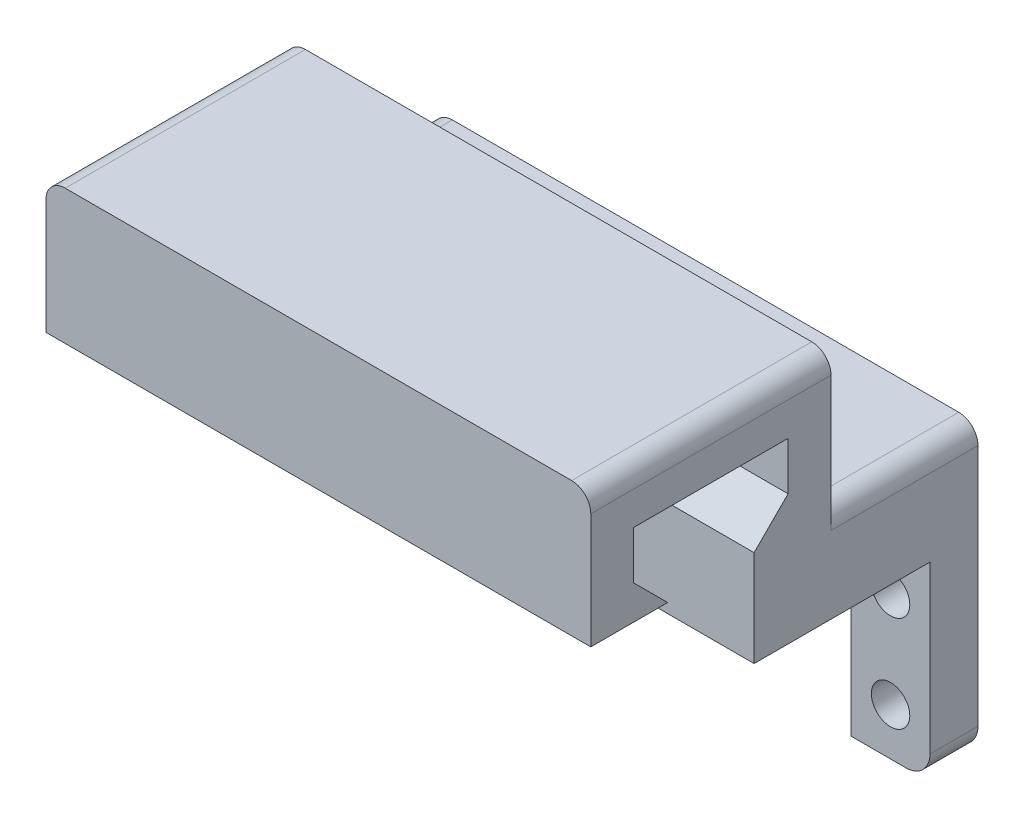
ISO-10303-21;
HEADER;
FILE_DESCRIPTION(('STEP AP214'),'2;1');
FILE_NAME('part.step','',(''),(''),'','','');
FILE_SCHEMA(('AUTOMOTIVE_DESIGN { 1 0 10303 214 1 1 1 1 }'));
ENDSEC;
DATA;
#1=APPLICATION_CONTEXT('core data for automotive mechanical design processes');
#2=APPLICATION_PROTOCOL_DEFINITION('international standard','automotive_design',2000,#1);
#3=PRODUCT_CONTEXT('',#1,'mechanical');
#4=PRODUCT('Part','Part','',(#3));
#5=PRODUCT_RELATED_PRODUCT_CATEGORY('part','',(#4));
#6=PRODUCT_DEFINITION_FORMATION('','',#4);
#7=PRODUCT_DEFINITION_CONTEXT('part definition',#1,'design');
#8=PRODUCT_DEFINITION('design','',#6,#7);
#9=PRODUCT_DEFINITION_SHAPE('','',#8);
#10=(LENGTH_UNIT() NAMED_UNIT(*) SI_UNIT(.MILLI.,.METRE.));
#11=(NAMED_UNIT(*) PLANE_ANGLE_UNIT() SI_UNIT($,.RADIAN.));
#12=(NAMED_UNIT(*) SI_UNIT($,.STERADIAN.) SOLID_ANGLE_UNIT());
#13=UNCERTAINTY_MEASURE_WITH_UNIT(LENGTH_MEASURE(1.E-05),#10,'distance_accuracy_value','');
#14=(GEOMETRIC_REPRESENTATION_CONTEXT(3) GLOBAL_UNCERTAINTY_ASSIGNED_CONTEXT((#13)) GLOBAL_UNIT_ASSIGNED_CONTEXT((#10,
#11,#12)) REPRESENTATION_CONTEXT('',''));
#15=CARTESIAN_POINT('',(0.,0.,0.));
#16=DIRECTION('',(0.,0.,1.));
#17=DIRECTION('',(1.,0.,0.));
#18=AXIS2_PLACEMENT_3D('',#15,#16,#17);
#19=CARTESIAN_POINT('',(-25.85,-7.4,5.));
#20=DIRECTION('',(0.,0.,-1.));
#21=DIRECTION('',(-1.,0.,0.));
#22=AXIS2_PLACEMENT_3D('',#19,#20,#21);
#23=CYLINDRICAL_SURFACE('',#22,2.5);
#24=CARTESIAN_POINT('',(-25.85,-7.4,0.));
#25=DIRECTION('',(0.,0.,1.));
#26=DIRECTION('',(1.,0.,0.));
#27=AXIS2_PLACEMENT_3D('',#24,#25,#26);
#28=CIRCLE('',#27,2.5);
#29=CARTESIAN_POINT('',(-25.85,-9.9,0.));
#30=VERTEX_POINT('',#29);
#31=CARTESIAN_POINT('',(-28.35,-7.39999999999998,0.));
#32=VERTEX_POINT('',#31);
#33=EDGE_CURVE('E326',#30,#32,#28,.F.);
#34=ORIENTED_EDGE('',*,*,#33,.F.);
#35=DIRECTION('',(0.,0.,-1.));
#36=VECTOR('',#35,1.);
#37=CARTESIAN_POINT('',(-25.85,-9.9,5.));
#38=LINE('',#37,#36);
#39=CARTESIAN_POINT('',(-25.85,-9.9,5.));
#40=VERTEX_POINT('',#39);
#41=EDGE_CURVE('E369',#40,#30,#38,.T.);
#42=ORIENTED_EDGE('',*,*,#41,.F.);
#43=CARTESIAN_POINT('',(-25.85,-7.4,5.));
#44=DIRECTION('',(0.,0.,1.));
#45=DIRECTION('',(1.,0.,0.));
#46=AXIS2_PLACEMENT_3D('',#43,#44,#45);
#47=CIRCLE('',#46,2.5);
#48=CARTESIAN_POINT('',(-28.35,-7.39999999999998,5.));
#49=VERTEX_POINT('',#48);
#50=EDGE_CURVE('E327',#40,#49,#47,.F.);
#51=ORIENTED_EDGE('',*,*,#50,.T.);
#52=DIRECTION('',(0.,0.,-1.));
#53=VECTOR('',#52,1.);
#54=CARTESIAN_POINT('',(-28.35,-7.39999999999998,5.));
#55=LINE('',#54,#53);
#56=EDGE_CURVE('E346',#49,#32,#55,.T.);
#57=ORIENTED_EDGE('',*,*,#56,.T.);
#58=EDGE_LOOP('',(#34,#42,#51,#57));
#59=FACE_BOUND('',#58,.T.);
#60=ADVANCED_FACE('F36',(#59),#23,.T.);
#61=CARTESIAN_POINT('',(0.,-9.9,5.));
#62=DIRECTION('',(0.,-1.,0.));
#63=DIRECTION('',(0.,0.,-1.));
#64=AXIS2_PLACEMENT_3D('',#61,#62,#63);
#65=PLANE('',#64);
#66=DIRECTION('',(-1.,0.,0.));
#67=VECTOR('',#66,1.);
#68=CARTESIAN_POINT('',(0.,-9.9,0.));
#69=LINE('',#68,#67);
#70=CARTESIAN_POINT('',(-20.15,-9.9,0.));
#71=VERTEX_POINT('',#70);
#72=EDGE_CURVE('E349',#71,#30,#69,.T.);
#73=ORIENTED_EDGE('',*,*,#72,.F.);
#74=DIRECTION('',(0.,0.,-1.));
#75=VECTOR('',#74,1.);
#76=CARTESIAN_POINT('',(-20.15,-9.9,5.));
#77=LINE('',#76,#75);
#78=CARTESIAN_POINT('',(-20.15,-9.9,5.));
#79=VERTEX_POINT('',#78);
#80=EDGE_CURVE('E367',#79,#71,#77,.T.);
#81=ORIENTED_EDGE('',*,*,#80,.F.);
#82=DIRECTION('',(-1.,0.,0.));
#83=VECTOR('',#82,1.);
#84=CARTESIAN_POINT('',(0.,-9.9,5.));
#85=LINE('',#84,#83);
#86=EDGE_CURVE('E330',#79,#40,#85,.T.);
#87=ORIENTED_EDGE('',*,*,#86,.T.);
#88=ORIENTED_EDGE('',*,*,#41,.T.);
#89=EDGE_LOOP('',(#73,#81,#87,#88));
#90=FACE_BOUND('',#89,.T.);
#91=ADVANCED_FACE('F493',(#90),#65,.T.);
#92=CARTESIAN_POINT('',(-20.15,0.,5.));
#93=DIRECTION('',(-1.,0.,0.));
#94=DIRECTION('',(0.,0.,1.));
#95=AXIS2_PLACEMENT_3D('',#92,#93,#94);
#96=PLANE('',#95);
#97=DIRECTION('',(0.,1.,0.));
#98=VECTOR('',#97,1.);
#99=CARTESIAN_POINT('',(-20.15,0.,0.));
#100=LINE('',#99,#98);
#101=CARTESIAN_POINT('',(-20.15,9.9,0.));
#102=VERTEX_POINT('',#101);
#103=EDGE_CURVE('E352',#71,#102,#100,.T.);
#104=ORIENTED_EDGE('',*,*,#103,.T.);
#105=DIRECTION('',(0.,0.,-1.));
#106=VECTOR('',#105,1.);
#107=CARTESIAN_POINT('',(-20.15,9.9,5.));
#108=LINE('',#107,#106);
#109=CARTESIAN_POINT('',(-20.15,9.9,5.));
#110=VERTEX_POINT('',#109);
#111=EDGE_CURVE('E364',#110,#102,#108,.T.);
#112=ORIENTED_EDGE('',*,*,#111,.F.);
#113=DIRECTION('',(0.,1.,0.));
#114=VECTOR('',#113,1.);
#115=CARTESIAN_POINT('',(-20.15,0.,5.));
#116=LINE('',#115,#114);
#117=EDGE_CURVE('E334',#79,#110,#116,.T.);
#118=ORIENTED_EDGE('',*,*,#117,.F.);
#119=ORIENTED_EDGE('',*,*,#80,.T.);
#120=EDGE_LOOP('',(#104,#112,#118,#119));
#121=FACE_BOUND('',#120,.T.);
#122=ADVANCED_FACE('F498',(#121),#96,.F.);
#123=CARTESIAN_POINT('',(-24.25,-5.,5.));
#124=DIRECTION('',(0.,0.,-1.));
#125=DIRECTION('',(-1.,0.,0.));
#126=AXIS2_PLACEMENT_3D('',#123,#124,#125);
#127=CYLINDRICAL_SURFACE('',#126,2.);
#128=CARTESIAN_POINT('',(-24.25,-5.,5.));
#129=DIRECTION('',(0.,0.,1.));
#130=DIRECTION('',(1.,0.,0.));
#131=AXIS2_PLACEMENT_3D('',#128,#129,#130);
#132=CIRCLE('',#131,2.);
#133=CARTESIAN_POINT('',(-22.25,-5.,5.));
#134=VERTEX_POINT('',#133);
#135=EDGE_CURVE('E340',#134,#134,#132,.T.);
#136=ORIENTED_EDGE('',*,*,#135,.T.);
#137=EDGE_LOOP('',(#136));
#138=FACE_BOUND('',#137,.T.);
#139=CARTESIAN_POINT('',(-24.25,-5.,0.));
#140=DIRECTION('',(0.,0.,1.));
#141=DIRECTION('',(1.,0.,0.));
#142=AXIS2_PLACEMENT_3D('',#139,#140,#141);
#143=CIRCLE('',#142,2.);
#144=CARTESIAN_POINT('',(-22.25,-5.,0.));
#145=VERTEX_POINT('',#144);
#146=EDGE_CURVE('E358',#145,#145,#143,.T.);
#147=ORIENTED_EDGE('',*,*,#146,.F.);
#148=EDGE_LOOP('',(#147));
#149=FACE_BOUND('',#148,.T.);
#150=ADVANCED_FACE('F604',(#138,#149),#127,.F.);
#151=CARTESIAN_POINT('',(-28.35,0.,5.));
#152=DIRECTION('',(-1.,0.,0.));
#153=DIRECTION('',(0.,0.,1.));
#154=AXIS2_PLACEMENT_3D('',#151,#152,#153);
#155=PLANE('',#154);
#156=DIRECTION('',(0.,1.,0.));
#157=VECTOR('',#156,1.);
#158=CARTESIAN_POINT('',(-28.35,19.9,15.3));
#159=LINE('',#158,#157);
#160=CARTESIAN_POINT('',(-28.35,17.9,15.3));
#161=VERTEX_POINT('',#160);
#162=CARTESIAN_POINT('',(-28.35,31.9,15.3));
#163=VERTEX_POINT('',#162);
#164=EDGE_CURVE('E239',#161,#163,#159,.T.);
#165=ORIENTED_EDGE('',*,*,#164,.F.);
#166=DIRECTION('',(0.,0.,1.));
#167=VECTOR('',#166,1.);
#168=CARTESIAN_POINT('',(-28.35,17.9,5.));
#169=LINE('',#168,#167);
#170=CARTESIAN_POINT('',(-28.35,17.9,0.));
#171=VERTEX_POINT('',#170);
#172=EDGE_CURVE('E378',#161,#171,#169,.F.);
#173=ORIENTED_EDGE('',*,*,#172,.T.);
#174=DIRECTION('',(0.,1.,0.));
#175=VECTOR('',#174,1.);
#176=CARTESIAN_POINT('',(-28.35,0.,0.));
#177=LINE('',#176,#175);
#178=EDGE_CURVE('E355',#32,#171,#177,.T.);
#179=ORIENTED_EDGE('',*,*,#178,.F.);
#180=ORIENTED_EDGE('',*,*,#56,.F.);
#181=DIRECTION('',(0.,1.,0.));
#182=VECTOR('',#181,1.);
#183=CARTESIAN_POINT('',(-28.35,0.,5.));
#184=LINE('',#183,#182);
#185=CARTESIAN_POINT('',(-28.35,9.9,5.));
#186=VERTEX_POINT('',#185);
#187=EDGE_CURVE('E338',#49,#186,#184,.T.);
#188=ORIENTED_EDGE('',*,*,#187,.T.);
#189=DIRECTION('',(0.,0.,-1.));
#190=VECTOR('',#189,1.);
#191=CARTESIAN_POINT('',(-28.35,9.9,23.3));
#192=LINE('',#191,#190);
#193=CARTESIAN_POINT('',(-28.35,9.9,23.3));
#194=VERTEX_POINT('',#193);
#195=EDGE_CURVE('E211',#194,#186,#192,.T.);
#196=ORIENTED_EDGE('',*,*,#195,.F.);
#197=DIRECTION('',(0.,1.,0.));
#198=VECTOR('',#197,1.);
#199=CARTESIAN_POINT('',(-28.35,0.,23.3));
#200=LINE('',#199,#198);
#201=CARTESIAN_POINT('',(-28.35,19.9,23.3));
#202=VERTEX_POINT('',#201);
#203=EDGE_CURVE('E203',#194,#202,#200,.T.);
#204=ORIENTED_EDGE('',*,*,#203,.T.);
#205=DIRECTION('',(0.,-0.707106781186542,0.707106781186553));
#206=VECTOR('',#205,1.);
#207=CARTESIAN_POINT('',(-28.35,19.9,23.3));
#208=LINE('',#207,#206);
#209=CARTESIAN_POINT('',(-28.35,23.4355339059327,19.7644660940672));
#210=VERTEX_POINT('',#209);
#211=EDGE_CURVE('E207',#210,#202,#208,.T.);
#212=ORIENTED_EDGE('',*,*,#211,.F.);
#213=DIRECTION('',(0.,-1.,0.));
#214=VECTOR('',#213,1.);
#215=CARTESIAN_POINT('',(-28.35,23.4355339059327,19.7644660940672));
#216=LINE('',#215,#214);
#217=CARTESIAN_POINT('',(-28.35,28.4355339059327,19.7644660940672));
#218=VERTEX_POINT('',#217);
#219=EDGE_CURVE('E235',#218,#210,#216,.T.);
#220=ORIENTED_EDGE('',*,*,#219,.F.);
#221=DIRECTION('',(0.,0.,-1.));
#222=VECTOR('',#221,1.);
#223=CARTESIAN_POINT('',(-28.35,28.4355339059327,19.7644660940672));
#224=LINE('',#223,#222);
#225=CARTESIAN_POINT('',(-28.35,28.4355339059327,35.8344660940672));
#226=VERTEX_POINT('',#225);
#227=EDGE_CURVE('E243',#226,#218,#224,.T.);
#228=ORIENTED_EDGE('',*,*,#227,.F.);
#229=DIRECTION('',(0.,1.,0.));
#230=VECTOR('',#229,1.);
#231=CARTESIAN_POINT('',(-28.35,28.4355339059327,35.8344660940672));
#232=LINE('',#231,#230);
#233=CARTESIAN_POINT('',(-28.35,23.4355339059328,35.8344660940672));
#234=VERTEX_POINT('',#233);
#235=EDGE_CURVE('E247',#234,#226,#232,.T.);
#236=ORIENTED_EDGE('',*,*,#235,.F.);
#237=DIRECTION('',(0.,0.707106781186551,0.707106781186544));
#238=VECTOR('',#237,1.);
#239=CARTESIAN_POINT('',(-28.35,23.4355339059328,35.8344660940672));
#240=LINE('',#239,#238);
#241=CARTESIAN_POINT('',(-28.35,19.9,32.2989321881345));
#242=VERTEX_POINT('',#241);
#243=EDGE_CURVE('E251',#242,#234,#240,.T.);
#244=ORIENTED_EDGE('',*,*,#243,.F.);
#245=DIRECTION('',(0.,0.,-1.));
#246=VECTOR('',#245,1.);
#247=CARTESIAN_POINT('',(-28.35,19.9,32.2989321881345));
#248=LINE('',#247,#246);
#249=CARTESIAN_POINT('',(-28.35,19.9,40.2989321881345));
#250=VERTEX_POINT('',#249);
#251=EDGE_CURVE('E255',#250,#242,#248,.T.);
#252=ORIENTED_EDGE('',*,*,#251,.F.);
#253=DIRECTION('',(0.,-1.,0.));
#254=VECTOR('',#253,1.);
#255=CARTESIAN_POINT('',(-28.35,19.9,40.2989321881345));
#256=LINE('',#255,#254);
#257=CARTESIAN_POINT('',(-28.35,31.9,40.2989321881345));
#258=VERTEX_POINT('',#257);
#259=EDGE_CURVE('E259',#258,#250,#256,.T.);
#260=ORIENTED_EDGE('',*,*,#259,.F.);
#261=DIRECTION('',(0.,0.,1.));
#262=VECTOR('',#261,1.);
#263=CARTESIAN_POINT('',(-28.35,31.9,5.));
#264=LINE('',#263,#262);
#265=EDGE_CURVE('E376',#258,#163,#264,.F.);
#266=ORIENTED_EDGE('',*,*,#265,.T.);
#267=EDGE_LOOP('',(#165,#173,#179,#180,#188,#196,#204,#212,#220,#228,#236,#244,#252,#260,#266));
#268=FACE_BOUND('',#267,.T.);
#269=ADVANCED_FACE('F205',(#268),#155,.T.);
#270=CARTESIAN_POINT('',(-24.25,5.,5.));
#271=DIRECTION('',(0.,0.,-1.));
#272=DIRECTION('',(-1.,0.,0.));
#273=AXIS2_PLACEMENT_3D('',#270,#271,#272);
#274=CYLINDRICAL_SURFACE('',#273,1.99999999999997);
#275=CARTESIAN_POINT('',(-24.25,5.,5.));
#276=DIRECTION('',(0.,0.,1.));
#277=DIRECTION('',(1.,0.,0.));
#278=AXIS2_PLACEMENT_3D('',#275,#276,#277);
#279=CIRCLE('',#278,1.99999999999997);
#280=CARTESIAN_POINT('',(-22.25,5.,5.));
#281=VERTEX_POINT('',#280);
#282=EDGE_CURVE('E343',#281,#281,#279,.T.);
#283=ORIENTED_EDGE('',*,*,#282,.T.);
#284=EDGE_LOOP('',(#283));
#285=FACE_BOUND('',#284,.T.);
#286=CARTESIAN_POINT('',(-24.25,5.,0.));
#287=DIRECTION('',(0.,0.,1.));
#288=DIRECTION('',(1.,0.,0.));
#289=AXIS2_PLACEMENT_3D('',#286,#287,#288);
#290=CIRCLE('',#289,1.99999999999997);
#291=CARTESIAN_POINT('',(-22.25,5.,0.));
#292=VERTEX_POINT('',#291);
#293=EDGE_CURVE('E331',#292,#292,#290,.T.);
#294=ORIENTED_EDGE('',*,*,#293,.F.);
#295=EDGE_LOOP('',(#294));
#296=FACE_BOUND('',#295,.T.);
#297=ADVANCED_FACE('F603',(#285,#296),#274,.F.);
#298=CARTESIAN_POINT('',(0.,0.,5.));
#299=DIRECTION('',(0.,0.,1.));
#300=DIRECTION('',(1.,0.,0.));
#301=AXIS2_PLACEMENT_3D('',#298,#299,#300);
#302=PLANE('',#301);
#303=ORIENTED_EDGE('',*,*,#50,.F.);
#304=ORIENTED_EDGE('',*,*,#86,.F.);
#305=ORIENTED_EDGE('',*,*,#117,.T.);
#306=DIRECTION('',(-1.,0.,0.));
#307=VECTOR('',#306,1.);
#308=CARTESIAN_POINT('',(0.,9.9,5.));
#309=LINE('',#308,#307);
#310=EDGE_CURVE('E336',#110,#186,#309,.T.);
#311=ORIENTED_EDGE('',*,*,#310,.T.);
#312=ORIENTED_EDGE('',*,*,#187,.F.);
#313=EDGE_LOOP('',(#303,#304,#305,#311,#312));
#314=FACE_BOUND('',#313,.T.);
#315=ORIENTED_EDGE('',*,*,#135,.F.);
#316=EDGE_LOOP('',(#315));
#317=FACE_BOUND('',#316,.T.);
#318=ORIENTED_EDGE('',*,*,#282,.F.);
#319=EDGE_LOOP('',(#318));
#320=FACE_BOUND('',#319,.T.);
#321=ADVANCED_FACE('F592',(#314,#317,#320),#302,.T.);
#322=CARTESIAN_POINT('',(0.,0.,0.));
#323=DIRECTION('',(0.,0.,1.));
#324=DIRECTION('',(1.,0.,0.));
#325=AXIS2_PLACEMENT_3D('',#322,#323,#324);
#326=PLANE('',#325);
#327=ORIENTED_EDGE('',*,*,#178,.T.);
#328=CARTESIAN_POINT('',(-26.35,17.9,0.));
#329=DIRECTION('',(0.,0.,1.));
#330=DIRECTION('',(1.,0.,0.));
#331=AXIS2_PLACEMENT_3D('',#328,#329,#330);
#332=CIRCLE('',#331,2.);
#333=CARTESIAN_POINT('',(-26.35,19.9,0.));
#334=VERTEX_POINT('',#333);
#335=EDGE_CURVE('E382',#171,#334,#332,.F.);
#336=ORIENTED_EDGE('',*,*,#335,.T.);
#337=DIRECTION('',(1.,0.,0.));
#338=VECTOR('',#337,1.);
#339=CARTESIAN_POINT('',(0.,19.9,0.));
#340=LINE('',#339,#338);
#341=CARTESIAN_POINT('',(26.35,19.9,0.));
#342=VERTEX_POINT('',#341);
#343=EDGE_CURVE('E312',#334,#342,#340,.T.);
#344=ORIENTED_EDGE('',*,*,#343,.T.);
#345=CARTESIAN_POINT('',(26.35,17.9,0.));
#346=DIRECTION('',(0.,0.,1.));
#347=DIRECTION('',(1.,0.,0.));
#348=AXIS2_PLACEMENT_3D('',#345,#346,#347);
#349=CIRCLE('',#348,2.);
#350=CARTESIAN_POINT('',(28.35,17.9,0.));
#351=VERTEX_POINT('',#350);
#352=EDGE_CURVE('E380',#342,#351,#349,.F.);
#353=ORIENTED_EDGE('',*,*,#352,.T.);
#354=DIRECTION('',(0.,1.,0.));
#355=VECTOR('',#354,1.);
#356=CARTESIAN_POINT('',(28.35,0.,0.));
#357=LINE('',#356,#355);
#358=CARTESIAN_POINT('',(28.35,-7.39999999999998,0.));
#359=VERTEX_POINT('',#358);
#360=EDGE_CURVE('E225',#359,#351,#357,.T.);
#361=ORIENTED_EDGE('',*,*,#360,.F.);
#362=CARTESIAN_POINT('',(25.85,-7.4,0.));
#363=DIRECTION('',(0.,0.,1.));
#364=DIRECTION('',(1.,0.,0.));
#365=AXIS2_PLACEMENT_3D('',#362,#363,#364);
#366=CIRCLE('',#365,2.5);
#367=CARTESIAN_POINT('',(25.85,-9.9,0.));
#368=VERTEX_POINT('',#367);
#369=EDGE_CURVE('E233',#359,#368,#366,.F.);
#370=ORIENTED_EDGE('',*,*,#369,.T.);
#371=DIRECTION('',(1.,0.,0.));
#372=VECTOR('',#371,1.);
#373=CARTESIAN_POINT('',(0.,-9.9,0.));
#374=LINE('',#373,#372);
#375=CARTESIAN_POINT('',(20.15,-9.9,0.));
#376=VERTEX_POINT('',#375);
#377=EDGE_CURVE('E297',#376,#368,#374,.T.);
#378=ORIENTED_EDGE('',*,*,#377,.F.);
#379=DIRECTION('',(0.,1.,0.));
#380=VECTOR('',#379,1.);
#381=CARTESIAN_POINT('',(20.15,0.,0.));
#382=LINE('',#381,#380);
#383=CARTESIAN_POINT('',(20.15,9.9,0.));
#384=VERTEX_POINT('',#383);
#385=EDGE_CURVE('E294',#376,#384,#382,.T.);
#386=ORIENTED_EDGE('',*,*,#385,.T.);
#387=DIRECTION('',(-1.,0.,0.));
#388=VECTOR('',#387,1.);
#389=CARTESIAN_POINT('',(0.,9.9,0.));
#390=LINE('',#389,#388);
#391=EDGE_CURVE('E319',#384,#102,#390,.T.);
#392=ORIENTED_EDGE('',*,*,#391,.T.);
#393=ORIENTED_EDGE('',*,*,#103,.F.);
#394=ORIENTED_EDGE('',*,*,#72,.T.);
#395=ORIENTED_EDGE('',*,*,#33,.T.);
#396=EDGE_LOOP('',(#327,#336,#344,#353,#361,#370,#378,#386,#392,#393,#394,#395));
#397=FACE_BOUND('',#396,.T.);
#398=ORIENTED_EDGE('',*,*,#146,.T.);
#399=EDGE_LOOP('',(#398));
#400=FACE_BOUND('',#399,.T.);
#401=ORIENTED_EDGE('',*,*,#293,.T.);
#402=EDGE_LOOP('',(#401));
#403=FACE_BOUND('',#402,.T.);
#404=CARTESIAN_POINT('',(24.25,5.,0.));
#405=DIRECTION('',(0.,0.,1.));
#406=DIRECTION('',(1.,0.,0.));
#407=AXIS2_PLACEMENT_3D('',#404,#405,#406);
#408=CIRCLE('',#407,1.99999999999997);
#409=CARTESIAN_POINT('',(26.25,5.,0.));
#410=VERTEX_POINT('',#409);
#411=EDGE_CURVE('E300',#410,#410,#408,.T.);
#412=ORIENTED_EDGE('',*,*,#411,.T.);
#413=EDGE_LOOP('',(#412));
#414=FACE_BOUND('',#413,.T.);
#415=CARTESIAN_POINT('',(24.25,-5.,0.));
#416=DIRECTION('',(0.,0.,1.));
#417=DIRECTION('',(1.,0.,0.));
#418=AXIS2_PLACEMENT_3D('',#415,#416,#417);
#419=CIRCLE('',#418,2.);
#420=CARTESIAN_POINT('',(26.25,-5.,0.));
#421=VERTEX_POINT('',#420);
#422=EDGE_CURVE('E275',#421,#421,#419,.T.);
#423=ORIENTED_EDGE('',*,*,#422,.T.);
#424=EDGE_LOOP('',(#423));
#425=FACE_BOUND('',#424,.T.);
#426=ADVANCED_FACE('F410',(#397,#400,#403,#414,#425),#326,.F.);
#427=CARTESIAN_POINT('',(0.,9.9,23.3));
#428=DIRECTION('',(0.,-1.,0.));
#429=DIRECTION('',(0.,0.,-1.));
#430=AXIS2_PLACEMENT_3D('',#427,#428,#429);
#431=PLANE('',#430);
#432=DIRECTION('',(0.,0.,-1.));
#433=VECTOR('',#432,1.);
#434=CARTESIAN_POINT('',(20.15,9.9,5.));
#435=LINE('',#434,#433);
#436=CARTESIAN_POINT('',(20.15,9.9,5.));
#437=VERTEX_POINT('',#436);
#438=EDGE_CURVE('E308',#437,#384,#435,.T.);
#439=ORIENTED_EDGE('',*,*,#438,.F.);
#440=DIRECTION('',(1.,0.,0.));
#441=VECTOR('',#440,1.);
#442=CARTESIAN_POINT('',(0.,9.9,5.));
#443=LINE('',#442,#441);
#444=CARTESIAN_POINT('',(28.35,9.9,5.));
#445=VERTEX_POINT('',#444);
#446=EDGE_CURVE('E277',#437,#445,#443,.T.);
#447=ORIENTED_EDGE('',*,*,#446,.T.);
#448=DIRECTION('',(0.,0.,-1.));
#449=VECTOR('',#448,1.);
#450=CARTESIAN_POINT('',(28.35,9.9,23.3));
#451=LINE('',#450,#449);
#452=CARTESIAN_POINT('',(28.35,9.9,23.3));
#453=VERTEX_POINT('',#452);
#454=EDGE_CURVE('E316',#453,#445,#451,.T.);
#455=ORIENTED_EDGE('',*,*,#454,.F.);
#456=DIRECTION('',(-1.,0.,0.));
#457=VECTOR('',#456,1.);
#458=CARTESIAN_POINT('',(0.,9.9,23.3));
#459=LINE('',#458,#457);
#460=EDGE_CURVE('E215',#453,#194,#459,.T.);
#461=ORIENTED_EDGE('',*,*,#460,.T.);
#462=ORIENTED_EDGE('',*,*,#195,.T.);
#463=ORIENTED_EDGE('',*,*,#310,.F.);
#464=ORIENTED_EDGE('',*,*,#111,.T.);
#465=ORIENTED_EDGE('',*,*,#391,.F.);
#466=EDGE_LOOP('',(#439,#447,#455,#461,#462,#463,#464,#465));
#467=FACE_BOUND('',#466,.T.);
#468=ADVANCED_FACE('F423',(#467),#431,.T.);
#469=CARTESIAN_POINT('',(0.,19.9,23.3));
#470=DIRECTION('',(0.,1.,0.));
#471=DIRECTION('',(0.,0.,1.));
#472=AXIS2_PLACEMENT_3D('',#469,#470,#471);
#473=PLANE('',#472);
#474=ORIENTED_EDGE('',*,*,#343,.F.);
#475=DIRECTION('',(0.,0.,1.));
#476=VECTOR('',#475,1.);
#477=CARTESIAN_POINT('',(-26.35,19.9,23.3));
#478=LINE('',#477,#476);
#479=CARTESIAN_POINT('',(-26.35,19.9,15.3));
#480=VERTEX_POINT('',#479);
#481=EDGE_CURVE('E373',#334,#480,#478,.T.);
#482=ORIENTED_EDGE('',*,*,#481,.T.);
#483=DIRECTION('',(1.,0.,0.));
#484=VECTOR('',#483,1.);
#485=CARTESIAN_POINT('',(-57.0021658962625,19.9,15.3));
#486=LINE('',#485,#484);
#487=CARTESIAN_POINT('',(26.35,19.9,15.3));
#488=VERTEX_POINT('',#487);
#489=EDGE_CURVE('E230',#480,#488,#486,.T.);
#490=ORIENTED_EDGE('',*,*,#489,.T.);
#491=DIRECTION('',(0.,0.,1.));
#492=VECTOR('',#491,1.);
#493=CARTESIAN_POINT('',(26.35,19.9,0.));
#494=LINE('',#493,#492);
#495=EDGE_CURVE('E371',#488,#342,#494,.F.);
#496=ORIENTED_EDGE('',*,*,#495,.T.);
#497=EDGE_LOOP('',(#474,#482,#490,#496));
#498=FACE_BOUND('',#497,.T.);
#499=ADVANCED_FACE('F569',(#498),#473,.T.);
#500=CARTESIAN_POINT('',(28.35,0.,23.3));
#501=DIRECTION('',(-1.,0.,0.));
#502=DIRECTION('',(0.,0.,1.));
#503=AXIS2_PLACEMENT_3D('',#500,#501,#502);
#504=PLANE('',#503);
#505=ORIENTED_EDGE('',*,*,#360,.T.);
#506=DIRECTION('',(0.,0.,1.));
#507=VECTOR('',#506,1.);
#508=CARTESIAN_POINT('',(28.35,17.9,15.3));
#509=LINE('',#508,#507);
#510=CARTESIAN_POINT('',(28.35,17.9,15.3));
#511=VERTEX_POINT('',#510);
#512=EDGE_CURVE('E387',#351,#511,#509,.T.);
#513=ORIENTED_EDGE('',*,*,#512,.T.);
#514=DIRECTION('',(0.,1.,0.));
#515=VECTOR('',#514,1.);
#516=CARTESIAN_POINT('',(28.35,19.9,15.3));
#517=LINE('',#516,#515);
#518=CARTESIAN_POINT('',(28.35,31.9,15.3));
#519=VERTEX_POINT('',#518);
#520=EDGE_CURVE('E447',#511,#519,#517,.T.);
#521=ORIENTED_EDGE('',*,*,#520,.T.);
#522=DIRECTION('',(0.,0.,1.));
#523=VECTOR('',#522,1.);
#524=CARTESIAN_POINT('',(28.35,31.9,40.2989321881345));
#525=LINE('',#524,#523);
#526=CARTESIAN_POINT('',(28.35,31.9,40.2989321881345));
#527=VERTEX_POINT('',#526);
#528=EDGE_CURVE('E384',#519,#527,#525,.T.);
#529=ORIENTED_EDGE('',*,*,#528,.T.);
#530=DIRECTION('',(0.,-1.,0.));
#531=VECTOR('',#530,1.);
#532=CARTESIAN_POINT('',(28.35,19.9,40.2989321881345));
#533=LINE('',#532,#531);
#534=CARTESIAN_POINT('',(28.35,19.9,40.2989321881345));
#535=VERTEX_POINT('',#534);
#536=EDGE_CURVE('E446',#527,#535,#533,.T.);
#537=ORIENTED_EDGE('',*,*,#536,.T.);
#538=DIRECTION('',(0.,0.,-1.));
#539=VECTOR('',#538,1.);
#540=CARTESIAN_POINT('',(28.35,19.9,32.2989321881345));
#541=LINE('',#540,#539);
#542=CARTESIAN_POINT('',(28.35,19.9,32.2989321881345));
#543=VERTEX_POINT('',#542);
#544=EDGE_CURVE('E443',#535,#543,#541,.T.);
#545=ORIENTED_EDGE('',*,*,#544,.T.);
#546=DIRECTION('',(0.,0.707106781186551,0.707106781186544));
#547=VECTOR('',#546,1.);
#548=CARTESIAN_POINT('',(28.35,23.4355339059328,35.8344660940672));
#549=LINE('',#548,#547);
#550=CARTESIAN_POINT('',(28.35,23.4355339059328,35.8344660940672));
#551=VERTEX_POINT('',#550);
#552=EDGE_CURVE('E440',#543,#551,#549,.T.);
#553=ORIENTED_EDGE('',*,*,#552,.T.);
#554=DIRECTION('',(0.,1.,0.));
#555=VECTOR('',#554,1.);
#556=CARTESIAN_POINT('',(28.35,28.4355339059327,35.8344660940672));
#557=LINE('',#556,#555);
#558=CARTESIAN_POINT('',(28.35,28.4355339059327,35.8344660940672));
#559=VERTEX_POINT('',#558);
#560=EDGE_CURVE('E437',#551,#559,#557,.T.);
#561=ORIENTED_EDGE('',*,*,#560,.T.);
#562=DIRECTION('',(0.,0.,-1.));
#563=VECTOR('',#562,1.);
#564=CARTESIAN_POINT('',(28.35,28.4355339059327,19.7644660940672));
#565=LINE('',#564,#563);
#566=CARTESIAN_POINT('',(28.35,28.4355339059327,19.7644660940672));
#567=VERTEX_POINT('',#566);
#568=EDGE_CURVE('E433',#559,#567,#565,.T.);
#569=ORIENTED_EDGE('',*,*,#568,.T.);
#570=DIRECTION('',(0.,-1.,0.));
#571=VECTOR('',#570,1.);
#572=CARTESIAN_POINT('',(28.35,23.4355339059327,19.7644660940672));
#573=LINE('',#572,#571);
#574=CARTESIAN_POINT('',(28.35,23.4355339059327,19.7644660940672));
#575=VERTEX_POINT('',#574);
#576=EDGE_CURVE('E431',#567,#575,#573,.T.);
#577=ORIENTED_EDGE('',*,*,#576,.T.);
#578=DIRECTION('',(0.,-0.707106781186542,0.707106781186553));
#579=VECTOR('',#578,1.);
#580=CARTESIAN_POINT('',(28.35,19.9,23.3));
#581=LINE('',#580,#579);
#582=CARTESIAN_POINT('',(28.35,19.9,23.3));
#583=VERTEX_POINT('',#582);
#584=EDGE_CURVE('E428',#575,#583,#581,.T.);
#585=ORIENTED_EDGE('',*,*,#584,.T.);
#586=DIRECTION('',(0.,1.,0.));
#587=VECTOR('',#586,1.);
#588=CARTESIAN_POINT('',(28.35,0.,23.3));
#589=LINE('',#588,#587);
#590=EDGE_CURVE('E221',#453,#583,#589,.T.);
#591=ORIENTED_EDGE('',*,*,#590,.F.);
#592=ORIENTED_EDGE('',*,*,#454,.T.);
#593=DIRECTION('',(0.,1.,0.));
#594=VECTOR('',#593,1.);
#595=CARTESIAN_POINT('',(28.35,0.,5.));
#596=LINE('',#595,#594);
#597=CARTESIAN_POINT('',(28.35,-7.39999999999998,5.));
#598=VERTEX_POINT('',#597);
#599=EDGE_CURVE('E274',#598,#445,#596,.T.);
#600=ORIENTED_EDGE('',*,*,#599,.F.);
#601=DIRECTION('',(0.,0.,-1.));
#602=VECTOR('',#601,1.);
#603=CARTESIAN_POINT('',(28.35,-7.39999999999998,5.));
#604=LINE('',#603,#602);
#605=EDGE_CURVE('E310',#598,#359,#604,.T.);
#606=ORIENTED_EDGE('',*,*,#605,.T.);
#607=EDGE_LOOP('',(#505,#513,#521,#529,#537,#545,#553,#561,#569,#577,#585,#591,#592,#600,#606));
#608=FACE_BOUND('',#607,.T.);
#609=ADVANCED_FACE('F426',(#608),#504,.F.);
#610=CARTESIAN_POINT('',(0.,0.,23.3));
#611=DIRECTION('',(0.,0.,1.));
#612=DIRECTION('',(1.,0.,0.));
#613=AXIS2_PLACEMENT_3D('',#610,#611,#612);
#614=PLANE('',#613);
#615=ORIENTED_EDGE('',*,*,#590,.T.);
#616=DIRECTION('',(1.,0.,0.));
#617=VECTOR('',#616,1.);
#618=CARTESIAN_POINT('',(0.,19.9,23.3));
#619=LINE('',#618,#617);
#620=EDGE_CURVE('E216',#202,#583,#619,.T.);
#621=ORIENTED_EDGE('',*,*,#620,.F.);
#622=ORIENTED_EDGE('',*,*,#203,.F.);
#623=ORIENTED_EDGE('',*,*,#460,.F.);
#624=EDGE_LOOP('',(#615,#621,#622,#623));
#625=FACE_BOUND('',#624,.T.);
#626=ADVANCED_FACE('F219',(#625),#614,.T.);
#627=CARTESIAN_POINT('',(25.85,-7.4,5.));
#628=DIRECTION('',(0.,0.,-1.));
#629=DIRECTION('',(-1.,0.,0.));
#630=AXIS2_PLACEMENT_3D('',#627,#628,#629);
#631=CYLINDRICAL_SURFACE('',#630,2.5);
#632=ORIENTED_EDGE('',*,*,#369,.F.);
#633=ORIENTED_EDGE('',*,*,#605,.F.);
#634=CARTESIAN_POINT('',(25.85,-7.4,5.));
#635=DIRECTION('',(0.,0.,1.));
#636=DIRECTION('',(1.,0.,0.));
#637=AXIS2_PLACEMENT_3D('',#634,#635,#636);
#638=CIRCLE('',#637,2.5);
#639=CARTESIAN_POINT('',(25.85,-9.9,5.));
#640=VERTEX_POINT('',#639);
#641=EDGE_CURVE('E271',#598,#640,#638,.F.);
#642=ORIENTED_EDGE('',*,*,#641,.T.);
#643=DIRECTION('',(0.,0.,-1.));
#644=VECTOR('',#643,1.);
#645=CARTESIAN_POINT('',(25.85,-9.9,5.));
#646=LINE('',#645,#644);
#647=EDGE_CURVE('E291',#640,#368,#646,.T.);
#648=ORIENTED_EDGE('',*,*,#647,.T.);
#649=EDGE_LOOP('',(#632,#633,#642,#648));
#650=FACE_BOUND('',#649,.T.);
#651=ADVANCED_FACE('F620',(#650),#631,.T.);
#652=CARTESIAN_POINT('',(20.15,0.,5.));
#653=DIRECTION('',(-1.,0.,0.));
#654=DIRECTION('',(0.,0.,1.));
#655=AXIS2_PLACEMENT_3D('',#652,#653,#654);
#656=PLANE('',#655);
#657=ORIENTED_EDGE('',*,*,#385,.F.);
#658=DIRECTION('',(0.,0.,-1.));
#659=VECTOR('',#658,1.);
#660=CARTESIAN_POINT('',(20.15,-9.9,5.));
#661=LINE('',#660,#659);
#662=CARTESIAN_POINT('',(20.15,-9.9,5.));
#663=VERTEX_POINT('',#662);
#664=EDGE_CURVE('E306',#663,#376,#661,.T.);
#665=ORIENTED_EDGE('',*,*,#664,.F.);
#666=DIRECTION('',(0.,1.,0.));
#667=VECTOR('',#666,1.);
#668=CARTESIAN_POINT('',(20.15,0.,5.));
#669=LINE('',#668,#667);
#670=EDGE_CURVE('E280',#663,#437,#669,.T.);
#671=ORIENTED_EDGE('',*,*,#670,.T.);
#672=ORIENTED_EDGE('',*,*,#438,.T.);
#673=EDGE_LOOP('',(#657,#665,#671,#672));
#674=FACE_BOUND('',#673,.T.);
#675=ADVANCED_FACE('F692',(#674),#656,.T.);
#676=CARTESIAN_POINT('',(24.25,5.,5.));
#677=DIRECTION('',(0.,0.,-1.));
#678=DIRECTION('',(-1.,0.,0.));
#679=AXIS2_PLACEMENT_3D('',#676,#677,#678);
#680=CYLINDRICAL_SURFACE('',#679,1.99999999999997);
#681=CARTESIAN_POINT('',(24.25,5.,5.));
#682=DIRECTION('',(0.,0.,1.));
#683=DIRECTION('',(1.,0.,0.));
#684=AXIS2_PLACEMENT_3D('',#681,#682,#683);
#685=CIRCLE('',#684,1.99999999999997);
#686=CARTESIAN_POINT('',(26.25,5.,5.));
#687=VERTEX_POINT('',#686);
#688=EDGE_CURVE('E285',#687,#687,#685,.T.);
#689=ORIENTED_EDGE('',*,*,#688,.T.);
#690=EDGE_LOOP('',(#689));
#691=FACE_BOUND('',#690,.T.);
#692=ORIENTED_EDGE('',*,*,#411,.F.);
#693=EDGE_LOOP('',(#692));
#694=FACE_BOUND('',#693,.T.);
#695=ADVANCED_FACE('F682',(#691,#694),#680,.F.);
#696=CARTESIAN_POINT('',(0.,-9.9,5.));
#697=DIRECTION('',(0.,1.,0.));
#698=DIRECTION('',(0.,0.,1.));
#699=AXIS2_PLACEMENT_3D('',#696,#697,#698);
#700=PLANE('',#699);
#701=ORIENTED_EDGE('',*,*,#377,.T.);
#702=ORIENTED_EDGE('',*,*,#647,.F.);
#703=DIRECTION('',(1.,0.,0.));
#704=VECTOR('',#703,1.);
#705=CARTESIAN_POINT('',(0.,-9.9,5.));
#706=LINE('',#705,#704);
#707=EDGE_CURVE('E283',#663,#640,#706,.T.);
#708=ORIENTED_EDGE('',*,*,#707,.F.);
#709=ORIENTED_EDGE('',*,*,#664,.T.);
#710=EDGE_LOOP('',(#701,#702,#708,#709));
#711=FACE_BOUND('',#710,.T.);
#712=ADVANCED_FACE('F672',(#711),#700,.F.);
#713=CARTESIAN_POINT('',(24.25,-5.,5.));
#714=DIRECTION('',(0.,0.,-1.));
#715=DIRECTION('',(-1.,0.,0.));
#716=AXIS2_PLACEMENT_3D('',#713,#714,#715);
#717=CYLINDRICAL_SURFACE('',#716,2.);
#718=CARTESIAN_POINT('',(24.25,-5.,5.));
#719=DIRECTION('',(0.,0.,1.));
#720=DIRECTION('',(1.,0.,0.));
#721=AXIS2_PLACEMENT_3D('',#718,#719,#720);
#722=CIRCLE('',#721,2.);
#723=CARTESIAN_POINT('',(26.25,-5.,5.));
#724=VERTEX_POINT('',#723);
#725=EDGE_CURVE('E288',#724,#724,#722,.T.);
#726=ORIENTED_EDGE('',*,*,#725,.T.);
#727=EDGE_LOOP('',(#726));
#728=FACE_BOUND('',#727,.T.);
#729=ORIENTED_EDGE('',*,*,#422,.F.);
#730=EDGE_LOOP('',(#729));
#731=FACE_BOUND('',#730,.T.);
#732=ADVANCED_FACE('F661',(#728,#731),#717,.F.);
#733=CARTESIAN_POINT('',(0.,0.,5.));
#734=DIRECTION('',(0.,0.,1.));
#735=DIRECTION('',(1.,0.,0.));
#736=AXIS2_PLACEMENT_3D('',#733,#734,#735);
#737=PLANE('',#736);
#738=ORIENTED_EDGE('',*,*,#641,.F.);
#739=ORIENTED_EDGE('',*,*,#599,.T.);
#740=ORIENTED_EDGE('',*,*,#446,.F.);
#741=ORIENTED_EDGE('',*,*,#670,.F.);
#742=ORIENTED_EDGE('',*,*,#707,.T.);
#743=EDGE_LOOP('',(#738,#739,#740,#741,#742));
#744=FACE_BOUND('',#743,.T.);
#745=ORIENTED_EDGE('',*,*,#688,.F.);
#746=EDGE_LOOP('',(#745));
#747=FACE_BOUND('',#746,.T.);
#748=ORIENTED_EDGE('',*,*,#725,.F.);
#749=EDGE_LOOP('',(#748));
#750=FACE_BOUND('',#749,.T.);
#751=ADVANCED_FACE('F558',(#744,#747,#750),#737,.T.);
#752=CARTESIAN_POINT('',(-57.0021658962625,19.9,15.3));
#753=DIRECTION('',(0.,0.,-1.));
#754=DIRECTION('',(0.,1.,0.));
#755=AXIS2_PLACEMENT_3D('',#752,#753,#754);
#756=PLANE('',#755);
#757=DIRECTION('',(1.,0.,0.));
#758=VECTOR('',#757,1.);
#759=CARTESIAN_POINT('',(-57.0021658962625,33.9,15.3));
#760=LINE('',#759,#758);
#761=CARTESIAN_POINT('',(-26.35,33.9,15.3));
#762=VERTEX_POINT('',#761);
#763=CARTESIAN_POINT('',(26.35,33.9,15.3));
#764=VERTEX_POINT('',#763);
#765=EDGE_CURVE('E269',#762,#764,#760,.T.);
#766=ORIENTED_EDGE('',*,*,#765,.T.);
#767=CARTESIAN_POINT('',(26.35,31.9,15.3));
#768=DIRECTION('',(0.,0.,-1.));
#769=DIRECTION('',(0.,1.,0.));
#770=AXIS2_PLACEMENT_3D('',#767,#768,#769);
#771=CIRCLE('',#770,2.);
#772=EDGE_CURVE('E399',#764,#519,#771,.T.);
#773=ORIENTED_EDGE('',*,*,#772,.T.);
#774=ORIENTED_EDGE('',*,*,#520,.F.);
#775=CARTESIAN_POINT('',(26.35,17.9,15.3));
#776=DIRECTION('',(0.,0.,-1.));
#777=DIRECTION('',(0.,1.,0.));
#778=AXIS2_PLACEMENT_3D('',#775,#776,#777);
#779=CIRCLE('',#778,2.);
#780=EDGE_CURVE('E11',#511,#488,#779,.F.);
#781=ORIENTED_EDGE('',*,*,#780,.T.);
#782=ORIENTED_EDGE('',*,*,#489,.F.);
#783=CARTESIAN_POINT('',(-26.35,17.9,15.3));
#784=DIRECTION('',(0.,0.,-1.));
#785=DIRECTION('',(0.,1.,0.));
#786=AXIS2_PLACEMENT_3D('',#783,#784,#785);
#787=CIRCLE('',#786,2.);
#788=EDGE_CURVE('E44',#480,#161,#787,.F.);
#789=ORIENTED_EDGE('',*,*,#788,.T.);
#790=ORIENTED_EDGE('',*,*,#164,.T.);
#791=CARTESIAN_POINT('',(-26.35,31.9,15.3));
#792=DIRECTION('',(0.,0.,-1.));
#793=DIRECTION('',(0.,1.,0.));
#794=AXIS2_PLACEMENT_3D('',#791,#792,#793);
#795=CIRCLE('',#794,2.);
#796=EDGE_CURVE('E58',#163,#762,#795,.T.);
#797=ORIENTED_EDGE('',*,*,#796,.T.);
#798=EDGE_LOOP('',(#766,#773,#774,#781,#782,#789,#790,#797));
#799=FACE_BOUND('',#798,.T.);
#800=ADVANCED_FACE('F403',(#799),#756,.T.);
#801=CARTESIAN_POINT('',(-57.0021658962625,33.9,40.2989321881345));
#802=DIRECTION('',(0.,1.,0.));
#803=DIRECTION('',(0.,0.,1.));
#804=AXIS2_PLACEMENT_3D('',#801,#802,#803);
#805=PLANE('',#804);
#806=DIRECTION('',(1.,0.,0.));
#807=VECTOR('',#806,1.);
#808=CARTESIAN_POINT('',(-57.0021658962625,33.9,40.2989321881345));
#809=LINE('',#808,#807);
#810=CARTESIAN_POINT('',(-26.35,33.9,40.2989321881345));
#811=VERTEX_POINT('',#810);
#812=CARTESIAN_POINT('',(26.35,33.9,40.2989321881345));
#813=VERTEX_POINT('',#812);
#814=EDGE_CURVE('E260',#811,#813,#809,.T.);
#815=ORIENTED_EDGE('',*,*,#814,.T.);
#816=DIRECTION('',(0.,0.,1.));
#817=VECTOR('',#816,1.);
#818=CARTESIAN_POINT('',(26.35,33.9,15.3));
#819=LINE('',#818,#817);
#820=EDGE_CURVE('E51',#813,#764,#819,.F.);
#821=ORIENTED_EDGE('',*,*,#820,.T.);
#822=ORIENTED_EDGE('',*,*,#765,.F.);
#823=DIRECTION('',(0.,0.,1.));
#824=VECTOR('',#823,1.);
#825=CARTESIAN_POINT('',(-26.35,33.9,40.2989321881345));
#826=LINE('',#825,#824);
#827=EDGE_CURVE('E394',#762,#811,#826,.T.);
#828=ORIENTED_EDGE('',*,*,#827,.T.);
#829=EDGE_LOOP('',(#815,#821,#822,#828));
#830=FACE_BOUND('',#829,.T.);
#831=ADVANCED_FACE('F459',(#830),#805,.T.);
#832=CARTESIAN_POINT('',(-57.0021658962625,19.9,40.2989321881345));
#833=DIRECTION('',(0.,0.,1.));
#834=DIRECTION('',(1.,0.,0.));
#835=AXIS2_PLACEMENT_3D('',#832,#833,#834);
#836=PLANE('',#835);
#837=ORIENTED_EDGE('',*,*,#536,.F.);
#838=CARTESIAN_POINT('',(26.35,31.9,40.2989321881345));
#839=DIRECTION('',(0.,0.,1.));
#840=DIRECTION('',(1.,0.,0.));
#841=AXIS2_PLACEMENT_3D('',#838,#839,#840);
#842=CIRCLE('',#841,2.);
#843=EDGE_CURVE('E392',#527,#813,#842,.T.);
#844=ORIENTED_EDGE('',*,*,#843,.T.);
#845=ORIENTED_EDGE('',*,*,#814,.F.);
#846=CARTESIAN_POINT('',(-26.35,31.9,40.2989321881345));
#847=DIRECTION('',(0.,0.,1.));
#848=DIRECTION('',(1.,0.,0.));
#849=AXIS2_PLACEMENT_3D('',#846,#847,#848);
#850=CIRCLE('',#849,2.);
#851=EDGE_CURVE('E390',#811,#258,#850,.T.);
#852=ORIENTED_EDGE('',*,*,#851,.T.);
#853=ORIENTED_EDGE('',*,*,#259,.T.);
#854=DIRECTION('',(1.,0.,0.));
#855=VECTOR('',#854,1.);
#856=CARTESIAN_POINT('',(-57.0021658962625,19.9,40.2989321881345));
#857=LINE('',#856,#855);
#858=EDGE_CURVE('E258',#250,#535,#857,.T.);
#859=ORIENTED_EDGE('',*,*,#858,.T.);
#860=EDGE_LOOP('',(#837,#844,#845,#852,#853,#859));
#861=FACE_BOUND('',#860,.T.);
#862=ADVANCED_FACE('F458',(#861),#836,.T.);
#863=CARTESIAN_POINT('',(-57.0021658962625,19.9,32.2989321881345));
#864=DIRECTION('',(0.,-1.,0.));
#865=DIRECTION('',(0.,0.,-1.));
#866=AXIS2_PLACEMENT_3D('',#863,#864,#865);
#867=PLANE('',#866);
#868=ORIENTED_EDGE('',*,*,#858,.F.);
#869=ORIENTED_EDGE('',*,*,#251,.T.);
#870=DIRECTION('',(1.,0.,0.));
#871=VECTOR('',#870,1.);
#872=CARTESIAN_POINT('',(-57.0021658962625,19.9,32.2989321881345));
#873=LINE('',#872,#871);
#874=EDGE_CURVE('E254',#242,#543,#873,.T.);
#875=ORIENTED_EDGE('',*,*,#874,.T.);
#876=ORIENTED_EDGE('',*,*,#544,.F.);
#877=EDGE_LOOP('',(#868,#869,#875,#876));
#878=FACE_BOUND('',#877,.T.);
#879=ADVANCED_FACE('F469',(#878),#867,.T.);
#880=CARTESIAN_POINT('',(-57.0021658962625,23.4355339059328,35.8344660940672));
#881=DIRECTION('',(0.,0.707106781186544,-0.707106781186551));
#882=DIRECTION('',(0.,0.707106781186551,0.707106781186544));
#883=AXIS2_PLACEMENT_3D('',#880,#881,#882);
#884=PLANE('',#883);
#885=ORIENTED_EDGE('',*,*,#874,.F.);
#886=ORIENTED_EDGE('',*,*,#243,.T.);
#887=DIRECTION('',(1.,0.,0.));
#888=VECTOR('',#887,1.);
#889=CARTESIAN_POINT('',(-57.0021658962625,23.4355339059328,35.8344660940672));
#890=LINE('',#889,#888);
#891=EDGE_CURVE('E250',#234,#551,#890,.T.);
#892=ORIENTED_EDGE('',*,*,#891,.T.);
#893=ORIENTED_EDGE('',*,*,#552,.F.);
#894=EDGE_LOOP('',(#885,#886,#892,#893));
#895=FACE_BOUND('',#894,.T.);
#896=ADVANCED_FACE('F473',(#895),#884,.T.);
#897=CARTESIAN_POINT('',(-57.0021658962625,28.4355339059327,35.8344660940672));
#898=DIRECTION('',(0.,0.,-1.));
#899=DIRECTION('',(0.,1.,0.));
#900=AXIS2_PLACEMENT_3D('',#897,#898,#899);
#901=PLANE('',#900);
#902=ORIENTED_EDGE('',*,*,#891,.F.);
#903=ORIENTED_EDGE('',*,*,#235,.T.);
#904=DIRECTION('',(1.,0.,0.));
#905=VECTOR('',#904,1.);
#906=CARTESIAN_POINT('',(-57.0021658962625,28.4355339059327,35.8344660940672));
#907=LINE('',#906,#905);
#908=EDGE_CURVE('E246',#226,#559,#907,.T.);
#909=ORIENTED_EDGE('',*,*,#908,.T.);
#910=ORIENTED_EDGE('',*,*,#560,.F.);
#911=EDGE_LOOP('',(#902,#903,#909,#910));
#912=FACE_BOUND('',#911,.T.);
#913=ADVANCED_FACE('F476',(#912),#901,.T.);
#914=CARTESIAN_POINT('',(-57.0021658962625,28.4355339059327,19.7644660940672));
#915=DIRECTION('',(0.,-1.,0.));
#916=DIRECTION('',(0.,0.,-1.));
#917=AXIS2_PLACEMENT_3D('',#914,#915,#916);
#918=PLANE('',#917);
#919=ORIENTED_EDGE('',*,*,#908,.F.);
#920=ORIENTED_EDGE('',*,*,#227,.T.);
#921=DIRECTION('',(1.,0.,0.));
#922=VECTOR('',#921,1.);
#923=CARTESIAN_POINT('',(-57.0021658962625,28.4355339059327,19.7644660940672));
#924=LINE('',#923,#922);
#925=EDGE_CURVE('E242',#218,#567,#924,.T.);
#926=ORIENTED_EDGE('',*,*,#925,.T.);
#927=ORIENTED_EDGE('',*,*,#568,.F.);
#928=EDGE_LOOP('',(#919,#920,#926,#927));
#929=FACE_BOUND('',#928,.T.);
#930=ADVANCED_FACE('F480',(#929),#918,.T.);
#931=CARTESIAN_POINT('',(-57.0021658962625,23.4355339059327,19.7644660940672));
#932=DIRECTION('',(0.,0.,1.));
#933=DIRECTION('',(0.,-1.,0.));
#934=AXIS2_PLACEMENT_3D('',#931,#932,#933);
#935=PLANE('',#934);
#936=ORIENTED_EDGE('',*,*,#925,.F.);
#937=ORIENTED_EDGE('',*,*,#219,.T.);
#938=DIRECTION('',(1.,0.,0.));
#939=VECTOR('',#938,1.);
#940=CARTESIAN_POINT('',(-57.0021658962625,23.4355339059327,19.7644660940672));
#941=LINE('',#940,#939);
#942=EDGE_CURVE('E228',#210,#575,#941,.T.);
#943=ORIENTED_EDGE('',*,*,#942,.T.);
#944=ORIENTED_EDGE('',*,*,#576,.F.);
#945=EDGE_LOOP('',(#936,#937,#943,#944));
#946=FACE_BOUND('',#945,.T.);
#947=ADVANCED_FACE('F483',(#946),#935,.T.);
#948=CARTESIAN_POINT('',(-57.0021658962625,19.9,23.3));
#949=DIRECTION('',(0.,0.707106781186553,0.707106781186542));
#950=DIRECTION('',(0.,-0.707106781186542,0.707106781186553));
#951=AXIS2_PLACEMENT_3D('',#948,#949,#950);
#952=PLANE('',#951);
#953=ORIENTED_EDGE('',*,*,#942,.F.);
#954=ORIENTED_EDGE('',*,*,#211,.T.);
#955=ORIENTED_EDGE('',*,*,#620,.T.);
#956=ORIENTED_EDGE('',*,*,#584,.F.);
#957=EDGE_LOOP('',(#953,#954,#955,#956));
#958=FACE_BOUND('',#957,.T.);
#959=ADVANCED_FACE('F227',(#958),#952,.T.);
#960=CARTESIAN_POINT('',(-26.35,17.9,23.3));
#961=DIRECTION('',(0.,0.,1.));
#962=DIRECTION('',(1.,0.,0.));
#963=AXIS2_PLACEMENT_3D('',#960,#961,#962);
#964=CYLINDRICAL_SURFACE('',#963,2.);
#965=ORIENTED_EDGE('',*,*,#335,.F.);
#966=ORIENTED_EDGE('',*,*,#172,.F.);
#967=ORIENTED_EDGE('',*,*,#788,.F.);
#968=ORIENTED_EDGE('',*,*,#481,.F.);
#969=EDGE_LOOP('',(#965,#966,#967,#968));
#970=FACE_BOUND('',#969,.T.);
#971=ADVANCED_FACE('F407',(#970),#964,.T.);
#972=CARTESIAN_POINT('',(26.35,17.9,23.3));
#973=DIRECTION('',(0.,0.,-1.));
#974=DIRECTION('',(-1.,0.,0.));
#975=AXIS2_PLACEMENT_3D('',#972,#973,#974);
#976=CYLINDRICAL_SURFACE('',#975,2.);
#977=ORIENTED_EDGE('',*,*,#352,.F.);
#978=ORIENTED_EDGE('',*,*,#495,.F.);
#979=ORIENTED_EDGE('',*,*,#780,.F.);
#980=ORIENTED_EDGE('',*,*,#512,.F.);
#981=EDGE_LOOP('',(#977,#978,#979,#980));
#982=FACE_BOUND('',#981,.T.);
#983=ADVANCED_FACE('F505',(#982),#976,.T.);
#984=CARTESIAN_POINT('',(26.35,31.9,23.3));
#985=DIRECTION('',(0.,0.,-1.));
#986=DIRECTION('',(-1.,0.,0.));
#987=AXIS2_PLACEMENT_3D('',#984,#985,#986);
#988=CYLINDRICAL_SURFACE('',#987,2.);
#989=ORIENTED_EDGE('',*,*,#772,.F.);
#990=ORIENTED_EDGE('',*,*,#820,.F.);
#991=ORIENTED_EDGE('',*,*,#843,.F.);
#992=ORIENTED_EDGE('',*,*,#528,.F.);
#993=EDGE_LOOP('',(#989,#990,#991,#992));
#994=FACE_BOUND('',#993,.T.);
#995=ADVANCED_FACE('F455',(#994),#988,.T.);
#996=CARTESIAN_POINT('',(-26.35,31.9,40.2989321881345));
#997=DIRECTION('',(0.,0.,1.));
#998=DIRECTION('',(1.,0.,0.));
#999=AXIS2_PLACEMENT_3D('',#996,#997,#998);
#1000=CYLINDRICAL_SURFACE('',#999,2.);
#1001=ORIENTED_EDGE('',*,*,#796,.F.);
#1002=ORIENTED_EDGE('',*,*,#265,.F.);
#1003=ORIENTED_EDGE('',*,*,#851,.F.);
#1004=ORIENTED_EDGE('',*,*,#827,.F.);
#1005=EDGE_LOOP('',(#1001,#1002,#1003,#1004));
#1006=FACE_BOUND('',#1005,.T.);
#1007=ADVANCED_FACE('F38',(#1006),#1000,.T.);
#1008=CLOSED_SHELL('',(#60,#91,#122,#150,#269,#297,#321,#426,#468,#499,#609,#626,#651,#675,#695,
#712,#732,#751,#800,#831,#862,#879,#896,#913,#930,#947,#959,#971,#983,#995,#1007));
#1009=MANIFOLD_SOLID_BREP('B2',#1008);
#1010=ADVANCED_BREP_SHAPE_REPRESENTATION('',(#18,#1009),#14);
#1011=SHAPE_DEFINITION_REPRESENTATION(#9,#1010);
ENDSEC;
END-ISO-10303-21;
